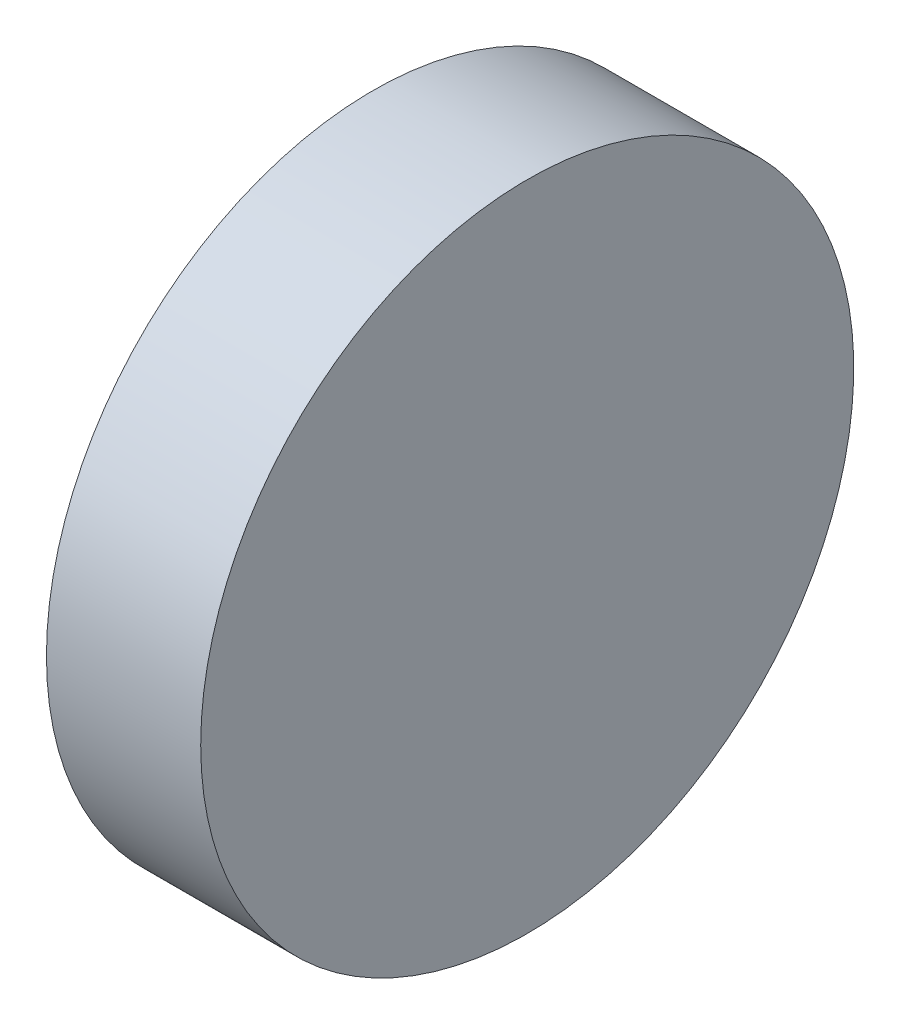
ISO-10303-21;
HEADER;
FILE_DESCRIPTION(('STEP AP214'),'2;1');
FILE_NAME('part.step','',(''),(''),'','','');
FILE_SCHEMA(('AUTOMOTIVE_DESIGN { 1 0 10303 214 1 1 1 1 }'));
ENDSEC;
DATA;
#1=APPLICATION_CONTEXT('core data for automotive mechanical design processes');
#2=APPLICATION_PROTOCOL_DEFINITION('international standard','automotive_design',2000,#1);
#3=PRODUCT_CONTEXT('',#1,'mechanical');
#4=PRODUCT('Part','Part','',(#3));
#5=PRODUCT_RELATED_PRODUCT_CATEGORY('part','',(#4));
#6=PRODUCT_DEFINITION_FORMATION('','',#4);
#7=PRODUCT_DEFINITION_CONTEXT('part definition',#1,'design');
#8=PRODUCT_DEFINITION('design','',#6,#7);
#9=PRODUCT_DEFINITION_SHAPE('','',#8);
#10=(LENGTH_UNIT() NAMED_UNIT(*) SI_UNIT(.MILLI.,.METRE.));
#11=(NAMED_UNIT(*) PLANE_ANGLE_UNIT() SI_UNIT($,.RADIAN.));
#12=(NAMED_UNIT(*) SI_UNIT($,.STERADIAN.) SOLID_ANGLE_UNIT());
#13=UNCERTAINTY_MEASURE_WITH_UNIT(LENGTH_MEASURE(1.E-05),#10,'distance_accuracy_value','');
#14=(GEOMETRIC_REPRESENTATION_CONTEXT(3) GLOBAL_UNCERTAINTY_ASSIGNED_CONTEXT((#13)) GLOBAL_UNIT_ASSIGNED_CONTEXT((#10,
#11,#12)) REPRESENTATION_CONTEXT('',''));
#15=CARTESIAN_POINT('',(0.,0.,0.));
#16=DIRECTION('',(0.,0.,1.));
#17=DIRECTION('',(1.,0.,0.));
#18=AXIS2_PLACEMENT_3D('',#15,#16,#17);
#19=CARTESIAN_POINT('',(265.724352893064,77.2931793490154,0.));
#20=DIRECTION('',(-1.,0.,0.));
#21=DIRECTION('',(0.,0.,1.));
#22=AXIS2_PLACEMENT_3D('',#19,#20,#21);
#23=PLANE('',#22);
#24=CARTESIAN_POINT('',(265.724352893064,77.2931793490154,0.));
#25=DIRECTION('',(-1.,0.,0.));
#26=DIRECTION('',(0.,0.,1.));
#27=AXIS2_PLACEMENT_3D('',#24,#25,#26);
#28=CIRCLE('',#27,12.7);
#29=CARTESIAN_POINT('',(265.724352893064,77.2931793490154,12.7));
#30=VERTEX_POINT('',#29);
#31=EDGE_CURVE('E10',#30,#30,#28,.T.);
#32=ORIENTED_EDGE('',*,*,#31,.F.);
#33=EDGE_LOOP('',(#32));
#34=FACE_BOUND('',#33,.T.);
#35=ADVANCED_FACE('F35',(#34),#23,.F.);
#36=CARTESIAN_POINT('',(254.000801992616,77.2931793490154,0.));
#37=DIRECTION('',(-1.,0.,0.));
#38=DIRECTION('',(0.,0.,1.));
#39=AXIS2_PLACEMENT_3D('',#36,#37,#38);
#40=CYLINDRICAL_SURFACE('',#39,12.7);
#41=CARTESIAN_POINT('',(259.724352893064,77.2931793490154,0.));
#42=DIRECTION('',(-1.,0.,0.));
#43=DIRECTION('',(0.,0.,1.));
#44=AXIS2_PLACEMENT_3D('',#41,#42,#43);
#45=CIRCLE('',#44,12.7);
#46=CARTESIAN_POINT('',(259.724352893064,77.2931793490154,12.7));
#47=VERTEX_POINT('',#46);
#48=EDGE_CURVE('E41',#47,#47,#45,.T.);
#49=ORIENTED_EDGE('',*,*,#48,.F.);
#50=EDGE_LOOP('',(#49));
#51=FACE_BOUND('',#50,.T.);
#52=ORIENTED_EDGE('',*,*,#31,.T.);
#53=EDGE_LOOP('',(#52));
#54=FACE_BOUND('',#53,.T.);
#55=ADVANCED_FACE('F49',(#51,#54),#40,.T.);
#56=CARTESIAN_POINT('',(259.724352893064,77.2931793490154,0.));
#57=DIRECTION('',(1.,0.,0.));
#58=DIRECTION('',(0.,0.,-1.));
#59=AXIS2_PLACEMENT_3D('',#56,#57,#58);
#60=PLANE('',#59);
#61=ORIENTED_EDGE('',*,*,#48,.T.);
#62=EDGE_LOOP('',(#61));
#63=FACE_BOUND('',#62,.T.);
#64=ADVANCED_FACE('F47',(#63),#60,.F.);
#65=CLOSED_SHELL('',(#35,#55,#64));
#66=MANIFOLD_SOLID_BREP('B2',#65);
#67=ADVANCED_BREP_SHAPE_REPRESENTATION('',(#18,#66),#14);
#68=SHAPE_DEFINITION_REPRESENTATION(#9,#67);
ENDSEC;
END-ISO-10303-21;
